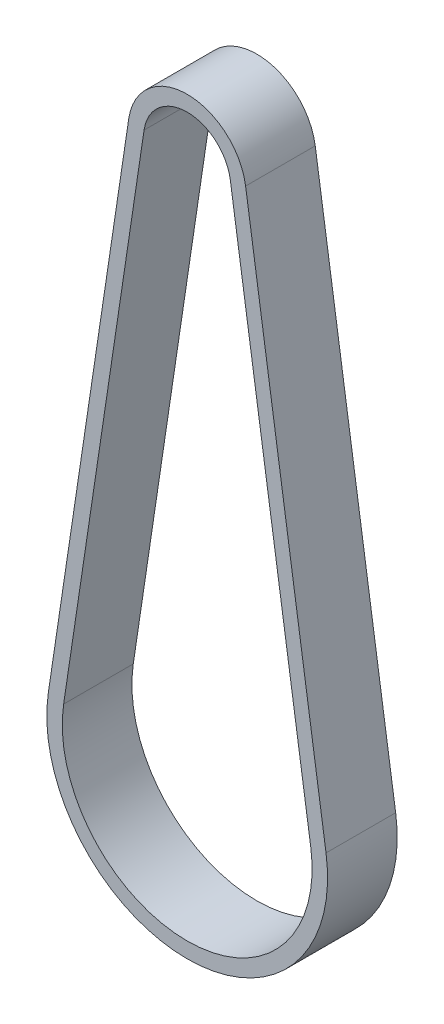
ISO-10303-21;
HEADER;
FILE_DESCRIPTION(('STEP AP214'),'2;1');
FILE_NAME('part.step','',(''),(''),'','','');
FILE_SCHEMA(('AUTOMOTIVE_DESIGN { 1 0 10303 214 1 1 1 1 }'));
ENDSEC;
DATA;
#1=APPLICATION_CONTEXT('core data for automotive mechanical design processes');
#2=APPLICATION_PROTOCOL_DEFINITION('international standard','automotive_design',2000,#1);
#3=PRODUCT_CONTEXT('',#1,'mechanical');
#4=PRODUCT('Part','Part','',(#3));
#5=PRODUCT_RELATED_PRODUCT_CATEGORY('part','',(#4));
#6=PRODUCT_DEFINITION_FORMATION('','',#4);
#7=PRODUCT_DEFINITION_CONTEXT('part definition',#1,'design');
#8=PRODUCT_DEFINITION('design','',#6,#7);
#9=PRODUCT_DEFINITION_SHAPE('','',#8);
#10=(LENGTH_UNIT() NAMED_UNIT(*) SI_UNIT(.MILLI.,.METRE.));
#11=(NAMED_UNIT(*) PLANE_ANGLE_UNIT() SI_UNIT($,.RADIAN.));
#12=(NAMED_UNIT(*) SI_UNIT($,.STERADIAN.) SOLID_ANGLE_UNIT());
#13=UNCERTAINTY_MEASURE_WITH_UNIT(LENGTH_MEASURE(1.E-05),#10,'distance_accuracy_value','');
#14=(GEOMETRIC_REPRESENTATION_CONTEXT(3) GLOBAL_UNCERTAINTY_ASSIGNED_CONTEXT((#13)) GLOBAL_UNIT_ASSIGNED_CONTEXT((#10,
#11,#12)) REPRESENTATION_CONTEXT('',''));
#15=CARTESIAN_POINT('',(0.,0.,0.));
#16=DIRECTION('',(0.,0.,1.));
#17=DIRECTION('',(1.,0.,0.));
#18=AXIS2_PLACEMENT_3D('',#15,#16,#17);
#19=CARTESIAN_POINT('',(0.,0.,4.5));
#20=DIRECTION('',(0.,0.,1.));
#21=DIRECTION('',(1.,0.,0.));
#22=AXIS2_PLACEMENT_3D('',#19,#20,#21);
#23=PLANE('',#22);
#24=CARTESIAN_POINT('',(0.,0.,4.5));
#25=DIRECTION('',(0.,0.,1.));
#26=DIRECTION('',(1.,0.,0.));
#27=AXIS2_PLACEMENT_3D('',#24,#25,#26);
#28=CIRCLE('',#27,7.635);
#29=CARTESIAN_POINT('',(7.5508863124002,1.13019507042254,4.5));
#30=VERTEX_POINT('',#29);
#31=CARTESIAN_POINT('',(-7.5508863124002,1.13019507042254,4.5));
#32=VERTEX_POINT('',#31);
#33=EDGE_CURVE('E164',#30,#32,#28,.T.);
#34=ORIENTED_EDGE('',*,*,#33,.T.);
#35=DIRECTION('',(-0.148028169014085,-0.988983145042592,0.));
#36=VECTOR('',#35,1.);
#37=CARTESIAN_POINT('',(-7.5508863124002,1.13019507042254,4.5));
#38=LINE('',#37,#36);
#39=CARTESIAN_POINT('',(-17.9450991667978,-68.3140288732394,4.5));
#40=VERTEX_POINT('',#39);
#41=EDGE_CURVE('E167',#32,#40,#38,.T.);
#42=ORIENTED_EDGE('',*,*,#41,.T.);
#43=CARTESIAN_POINT('',(0.,-71.,4.5));
#44=DIRECTION('',(0.,0.,1.));
#45=DIRECTION('',(1.,0.,0.));
#46=AXIS2_PLACEMENT_3D('',#43,#44,#45);
#47=CIRCLE('',#46,18.145);
#48=CARTESIAN_POINT('',(17.9450991667978,-68.3140288732394,4.5));
#49=VERTEX_POINT('',#48);
#50=EDGE_CURVE('E170',#40,#49,#47,.T.);
#51=ORIENTED_EDGE('',*,*,#50,.T.);
#52=DIRECTION('',(-0.148028169014085,0.988983145042592,0.));
#53=VECTOR('',#52,1.);
#54=CARTESIAN_POINT('',(7.5508863124002,1.13019507042254,4.5));
#55=LINE('',#54,#53);
#56=EDGE_CURVE('E172',#49,#30,#55,.T.);
#57=ORIENTED_EDGE('',*,*,#56,.T.);
#58=EDGE_LOOP('',(#34,#42,#51,#57));
#59=FACE_BOUND('',#58,.T.);
#60=DIRECTION('',(-0.148028169014085,-0.988983145042593,0.));
#61=VECTOR('',#60,1.);
#62=CARTESIAN_POINT('',(-5.57292002231501,0.834138732394366,4.5));
#63=LINE('',#62,#61);
#64=CARTESIAN_POINT('',(-5.57292002231501,0.834138732394366,4.5));
#65=VERTEX_POINT('',#64);
#66=CARTESIAN_POINT('',(-15.9671328767127,-68.6100852112676,4.5));
#67=VERTEX_POINT('',#66);
#68=EDGE_CURVE('E136',#65,#67,#63,.T.);
#69=ORIENTED_EDGE('',*,*,#68,.F.);
#70=CARTESIAN_POINT('',(0.,0.,4.5));
#71=DIRECTION('',(0.,0.,1.));
#72=DIRECTION('',(1.,0.,0.));
#73=AXIS2_PLACEMENT_3D('',#70,#71,#72);
#74=CIRCLE('',#73,5.635);
#75=CARTESIAN_POINT('',(5.57292002231501,0.834138732394366,4.5));
#76=VERTEX_POINT('',#75);
#77=EDGE_CURVE('E128',#76,#65,#74,.T.);
#78=ORIENTED_EDGE('',*,*,#77,.F.);
#79=DIRECTION('',(-0.148028169014085,0.988983145042593,0.));
#80=VECTOR('',#79,1.);
#81=CARTESIAN_POINT('',(5.57292002231501,0.834138732394366,4.5));
#82=LINE('',#81,#80);
#83=CARTESIAN_POINT('',(15.9671328767127,-68.6100852112676,4.5));
#84=VERTEX_POINT('',#83);
#85=EDGE_CURVE('E150',#84,#76,#82,.T.);
#86=ORIENTED_EDGE('',*,*,#85,.F.);
#87=CARTESIAN_POINT('',(0.,-71.,4.5));
#88=DIRECTION('',(0.,0.,1.));
#89=DIRECTION('',(1.,0.,0.));
#90=AXIS2_PLACEMENT_3D('',#87,#88,#89);
#91=CIRCLE('',#90,16.145);
#92=EDGE_CURVE('E148',#67,#84,#91,.T.);
#93=ORIENTED_EDGE('',*,*,#92,.F.);
#94=EDGE_LOOP('',(#69,#78,#86,#93));
#95=FACE_BOUND('',#94,.T.);
#96=ADVANCED_FACE('F63',(#59,#95),#23,.T.);
#97=CARTESIAN_POINT('',(0.,0.,-4.5));
#98=DIRECTION('',(0.,0.,1.));
#99=DIRECTION('',(1.,0.,0.));
#100=AXIS2_PLACEMENT_3D('',#97,#98,#99);
#101=PLANE('',#100);
#102=CARTESIAN_POINT('',(0.,0.,-4.5));
#103=DIRECTION('',(0.,0.,1.));
#104=DIRECTION('',(1.,0.,0.));
#105=AXIS2_PLACEMENT_3D('',#102,#103,#104);
#106=CIRCLE('',#105,7.635);
#107=CARTESIAN_POINT('',(7.5508863124002,1.13019507042254,-4.5));
#108=VERTEX_POINT('',#107);
#109=CARTESIAN_POINT('',(-7.5508863124002,1.13019507042254,-4.5));
#110=VERTEX_POINT('',#109);
#111=EDGE_CURVE('E144',#108,#110,#106,.T.);
#112=ORIENTED_EDGE('',*,*,#111,.F.);
#113=DIRECTION('',(-0.148028169014085,0.988983145042592,0.));
#114=VECTOR('',#113,1.);
#115=CARTESIAN_POINT('',(7.5508863124002,1.13019507042254,-4.5));
#116=LINE('',#115,#114);
#117=CARTESIAN_POINT('',(17.9450991667978,-68.3140288732394,-4.5));
#118=VERTEX_POINT('',#117);
#119=EDGE_CURVE('E168',#118,#108,#116,.T.);
#120=ORIENTED_EDGE('',*,*,#119,.F.);
#121=CARTESIAN_POINT('',(0.,-71.,-4.5));
#122=DIRECTION('',(0.,0.,1.));
#123=DIRECTION('',(1.,0.,0.));
#124=AXIS2_PLACEMENT_3D('',#121,#122,#123);
#125=CIRCLE('',#124,18.145);
#126=CARTESIAN_POINT('',(-17.9450991667978,-68.3140288732394,-4.5));
#127=VERTEX_POINT('',#126);
#128=EDGE_CURVE('E179',#127,#118,#125,.T.);
#129=ORIENTED_EDGE('',*,*,#128,.F.);
#130=DIRECTION('',(-0.148028169014085,-0.988983145042592,0.));
#131=VECTOR('',#130,1.);
#132=CARTESIAN_POINT('',(-7.5508863124002,1.13019507042254,-4.5));
#133=LINE('',#132,#131);
#134=EDGE_CURVE('E177',#110,#127,#133,.T.);
#135=ORIENTED_EDGE('',*,*,#134,.F.);
#136=EDGE_LOOP('',(#112,#120,#129,#135));
#137=FACE_BOUND('',#136,.T.);
#138=CARTESIAN_POINT('',(0.,0.,-4.5));
#139=DIRECTION('',(0.,0.,1.));
#140=DIRECTION('',(1.,0.,0.));
#141=AXIS2_PLACEMENT_3D('',#138,#139,#140);
#142=CIRCLE('',#141,5.635);
#143=CARTESIAN_POINT('',(5.57292002231501,0.834138732394366,-4.5));
#144=VERTEX_POINT('',#143);
#145=CARTESIAN_POINT('',(-5.57292002231501,0.834138732394366,-4.5));
#146=VERTEX_POINT('',#145);
#147=EDGE_CURVE('E86',#144,#146,#142,.T.);
#148=ORIENTED_EDGE('',*,*,#147,.T.);
#149=DIRECTION('',(-0.148028169014085,-0.988983145042593,0.));
#150=VECTOR('',#149,1.);
#151=CARTESIAN_POINT('',(-5.57292002231501,0.834138732394366,-4.5));
#152=LINE('',#151,#150);
#153=CARTESIAN_POINT('',(-15.9671328767127,-68.6100852112676,-4.5));
#154=VERTEX_POINT('',#153);
#155=EDGE_CURVE('E143',#146,#154,#152,.T.);
#156=ORIENTED_EDGE('',*,*,#155,.T.);
#157=CARTESIAN_POINT('',(0.,-71.,-4.5));
#158=DIRECTION('',(0.,0.,1.));
#159=DIRECTION('',(1.,0.,0.));
#160=AXIS2_PLACEMENT_3D('',#157,#158,#159);
#161=CIRCLE('',#160,16.145);
#162=CARTESIAN_POINT('',(15.9671328767127,-68.6100852112676,-4.5));
#163=VERTEX_POINT('',#162);
#164=EDGE_CURVE('E156',#154,#163,#161,.T.);
#165=ORIENTED_EDGE('',*,*,#164,.T.);
#166=DIRECTION('',(-0.148028169014085,0.988983145042593,0.));
#167=VECTOR('',#166,1.);
#168=CARTESIAN_POINT('',(5.57292002231501,0.834138732394366,-4.5));
#169=LINE('',#168,#167);
#170=EDGE_CURVE('E137',#163,#144,#169,.T.);
#171=ORIENTED_EDGE('',*,*,#170,.T.);
#172=EDGE_LOOP('',(#148,#156,#165,#171));
#173=FACE_BOUND('',#172,.T.);
#174=ADVANCED_FACE('F197',(#137,#173),#101,.F.);
#175=CARTESIAN_POINT('',(0.,0.,4.5));
#176=DIRECTION('',(0.,0.,-1.));
#177=DIRECTION('',(-1.,0.,0.));
#178=AXIS2_PLACEMENT_3D('',#175,#176,#177);
#179=CYLINDRICAL_SURFACE('',#178,7.635);
#180=ORIENTED_EDGE('',*,*,#111,.T.);
#181=DIRECTION('',(0.,0.,-1.));
#182=VECTOR('',#181,1.);
#183=CARTESIAN_POINT('',(-7.5508863124002,1.13019507042254,4.5));
#184=LINE('',#183,#182);
#185=EDGE_CURVE('E12',#32,#110,#184,.T.);
#186=ORIENTED_EDGE('',*,*,#185,.F.);
#187=ORIENTED_EDGE('',*,*,#33,.F.);
#188=DIRECTION('',(0.,0.,-1.));
#189=VECTOR('',#188,1.);
#190=CARTESIAN_POINT('',(7.5508863124002,1.13019507042254,4.5));
#191=LINE('',#190,#189);
#192=EDGE_CURVE('E174',#30,#108,#191,.T.);
#193=ORIENTED_EDGE('',*,*,#192,.T.);
#194=EDGE_LOOP('',(#180,#186,#187,#193));
#195=FACE_BOUND('',#194,.T.);
#196=ADVANCED_FACE('F65',(#195),#179,.T.);
#197=CARTESIAN_POINT('',(-7.5508863124002,1.13019507042254,4.5));
#198=DIRECTION('',(0.988983145042592,-0.148028169014085,0.));
#199=DIRECTION('',(0.148028169014085,0.988983145042593,0.));
#200=AXIS2_PLACEMENT_3D('',#197,#198,#199);
#201=PLANE('',#200);
#202=ORIENTED_EDGE('',*,*,#134,.T.);
#203=DIRECTION('',(0.,0.,-1.));
#204=VECTOR('',#203,1.);
#205=CARTESIAN_POINT('',(-17.9450991667978,-68.3140288732394,4.5));
#206=LINE('',#205,#204);
#207=EDGE_CURVE('E71',#40,#127,#206,.T.);
#208=ORIENTED_EDGE('',*,*,#207,.F.);
#209=ORIENTED_EDGE('',*,*,#41,.F.);
#210=ORIENTED_EDGE('',*,*,#185,.T.);
#211=EDGE_LOOP('',(#202,#208,#209,#210));
#212=FACE_BOUND('',#211,.T.);
#213=ADVANCED_FACE('F207',(#212),#201,.F.);
#214=CARTESIAN_POINT('',(0.,-71.,4.5));
#215=DIRECTION('',(0.,0.,-1.));
#216=DIRECTION('',(-1.,0.,0.));
#217=AXIS2_PLACEMENT_3D('',#214,#215,#216);
#218=CYLINDRICAL_SURFACE('',#217,18.145);
#219=ORIENTED_EDGE('',*,*,#128,.T.);
#220=DIRECTION('',(0.,0.,-1.));
#221=VECTOR('',#220,1.);
#222=CARTESIAN_POINT('',(17.9450991667978,-68.3140288732394,4.5));
#223=LINE('',#222,#221);
#224=EDGE_CURVE('E184',#49,#118,#223,.T.);
#225=ORIENTED_EDGE('',*,*,#224,.F.);
#226=ORIENTED_EDGE('',*,*,#50,.F.);
#227=ORIENTED_EDGE('',*,*,#207,.T.);
#228=EDGE_LOOP('',(#219,#225,#226,#227));
#229=FACE_BOUND('',#228,.T.);
#230=ADVANCED_FACE('F191',(#229),#218,.T.);
#231=CARTESIAN_POINT('',(7.5508863124002,1.13019507042254,4.5));
#232=DIRECTION('',(-0.988983145042592,-0.148028169014085,0.));
#233=DIRECTION('',(0.148028169014085,-0.988983145042593,0.));
#234=AXIS2_PLACEMENT_3D('',#231,#232,#233);
#235=PLANE('',#234);
#236=ORIENTED_EDGE('',*,*,#119,.T.);
#237=ORIENTED_EDGE('',*,*,#192,.F.);
#238=ORIENTED_EDGE('',*,*,#56,.F.);
#239=ORIENTED_EDGE('',*,*,#224,.T.);
#240=EDGE_LOOP('',(#236,#237,#238,#239));
#241=FACE_BOUND('',#240,.T.);
#242=ADVANCED_FACE('F201',(#241),#235,.F.);
#243=CARTESIAN_POINT('',(0.,0.,4.5));
#244=DIRECTION('',(0.,0.,-1.));
#245=DIRECTION('',(-1.,0.,0.));
#246=AXIS2_PLACEMENT_3D('',#243,#244,#245);
#247=CYLINDRICAL_SURFACE('',#246,5.635);
#248=ORIENTED_EDGE('',*,*,#147,.F.);
#249=DIRECTION('',(0.,0.,-1.));
#250=VECTOR('',#249,1.);
#251=CARTESIAN_POINT('',(5.57292002231501,0.834138732394366,4.5));
#252=LINE('',#251,#250);
#253=EDGE_CURVE('E132',#76,#144,#252,.T.);
#254=ORIENTED_EDGE('',*,*,#253,.F.);
#255=ORIENTED_EDGE('',*,*,#77,.T.);
#256=DIRECTION('',(0.,0.,-1.));
#257=VECTOR('',#256,1.);
#258=CARTESIAN_POINT('',(-5.57292002231501,0.834138732394366,4.5));
#259=LINE('',#258,#257);
#260=EDGE_CURVE('E131',#65,#146,#259,.T.);
#261=ORIENTED_EDGE('',*,*,#260,.T.);
#262=EDGE_LOOP('',(#248,#254,#255,#261));
#263=FACE_BOUND('',#262,.T.);
#264=ADVANCED_FACE('F130',(#263),#247,.F.);
#265=CARTESIAN_POINT('',(-5.57292002231501,0.834138732394366,4.5));
#266=DIRECTION('',(0.988983145042592,-0.148028169014085,0.));
#267=DIRECTION('',(0.148028169014085,0.988983145042593,0.));
#268=AXIS2_PLACEMENT_3D('',#265,#266,#267);
#269=PLANE('',#268);
#270=ORIENTED_EDGE('',*,*,#155,.F.);
#271=ORIENTED_EDGE('',*,*,#260,.F.);
#272=ORIENTED_EDGE('',*,*,#68,.T.);
#273=DIRECTION('',(0.,0.,-1.));
#274=VECTOR('',#273,1.);
#275=CARTESIAN_POINT('',(-15.9671328767127,-68.6100852112676,4.5));
#276=LINE('',#275,#274);
#277=EDGE_CURVE('E145',#67,#154,#276,.T.);
#278=ORIENTED_EDGE('',*,*,#277,.T.);
#279=EDGE_LOOP('',(#270,#271,#272,#278));
#280=FACE_BOUND('',#279,.T.);
#281=ADVANCED_FACE('F140',(#280),#269,.T.);
#282=CARTESIAN_POINT('',(0.,-71.,4.5));
#283=DIRECTION('',(0.,0.,-1.));
#284=DIRECTION('',(-1.,0.,0.));
#285=AXIS2_PLACEMENT_3D('',#282,#283,#284);
#286=CYLINDRICAL_SURFACE('',#285,16.145);
#287=ORIENTED_EDGE('',*,*,#164,.F.);
#288=ORIENTED_EDGE('',*,*,#277,.F.);
#289=ORIENTED_EDGE('',*,*,#92,.T.);
#290=DIRECTION('',(0.,0.,-1.));
#291=VECTOR('',#290,1.);
#292=CARTESIAN_POINT('',(15.9671328767127,-68.6100852112676,4.5));
#293=LINE('',#292,#291);
#294=EDGE_CURVE('E78',#84,#163,#293,.T.);
#295=ORIENTED_EDGE('',*,*,#294,.T.);
#296=EDGE_LOOP('',(#287,#288,#289,#295));
#297=FACE_BOUND('',#296,.T.);
#298=ADVANCED_FACE('F230',(#297),#286,.F.);
#299=CARTESIAN_POINT('',(5.57292002231501,0.834138732394366,4.5));
#300=DIRECTION('',(-0.988983145042592,-0.148028169014085,0.));
#301=DIRECTION('',(0.148028169014085,-0.988983145042593,0.));
#302=AXIS2_PLACEMENT_3D('',#299,#300,#301);
#303=PLANE('',#302);
#304=ORIENTED_EDGE('',*,*,#170,.F.);
#305=ORIENTED_EDGE('',*,*,#294,.F.);
#306=ORIENTED_EDGE('',*,*,#85,.T.);
#307=ORIENTED_EDGE('',*,*,#253,.T.);
#308=EDGE_LOOP('',(#304,#305,#306,#307));
#309=FACE_BOUND('',#308,.T.);
#310=ADVANCED_FACE('F234',(#309),#303,.T.);
#311=CLOSED_SHELL('',(#96,#174,#196,#213,#230,#242,#264,#281,#298,#310));
#312=MANIFOLD_SOLID_BREP('B2',#311);
#313=ADVANCED_BREP_SHAPE_REPRESENTATION('',(#18,#312),#14);
#314=SHAPE_DEFINITION_REPRESENTATION(#9,#313);
ENDSEC;
END-ISO-10303-21;
